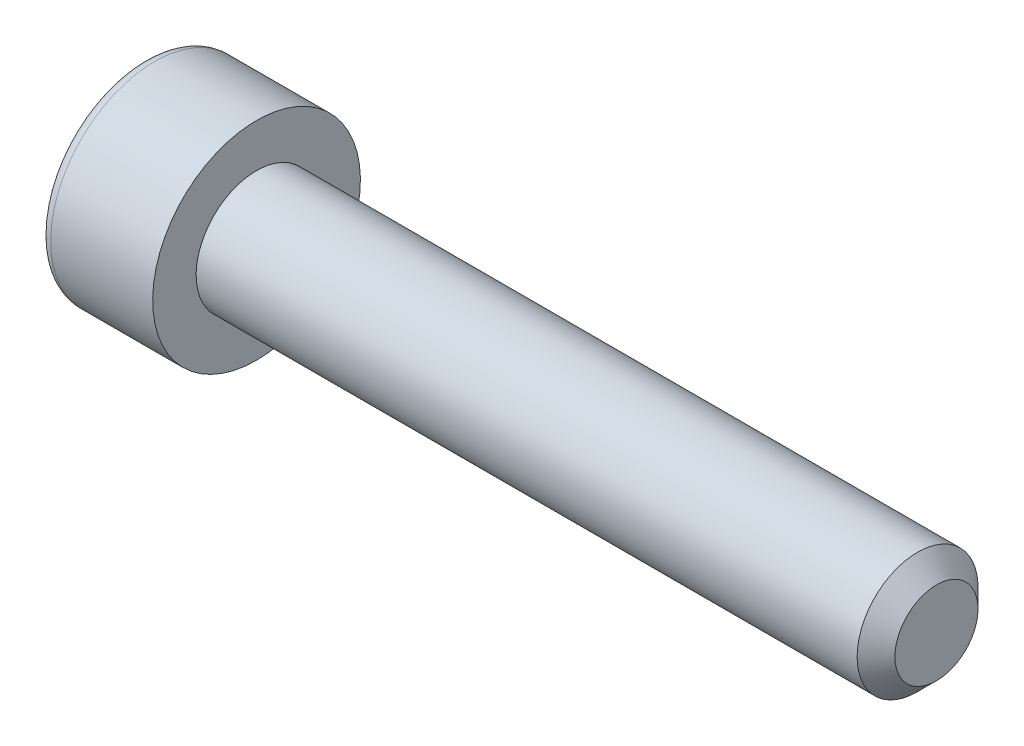
ISO-10303-21;
HEADER;
FILE_DESCRIPTION(('STEP AP214'),'2;1');
FILE_NAME('part.step','',(''),(''),'','','');
FILE_SCHEMA(('AUTOMOTIVE_DESIGN { 1 0 10303 214 1 1 1 1 }'));
ENDSEC;
DATA;
#1=APPLICATION_CONTEXT('core data for automotive mechanical design processes');
#2=APPLICATION_PROTOCOL_DEFINITION('international standard','automotive_design',2000,#1);
#3=PRODUCT_CONTEXT('',#1,'mechanical');
#4=PRODUCT('Part','Part','',(#3));
#5=PRODUCT_RELATED_PRODUCT_CATEGORY('part','',(#4));
#6=PRODUCT_DEFINITION_FORMATION('','',#4);
#7=PRODUCT_DEFINITION_CONTEXT('part definition',#1,'design');
#8=PRODUCT_DEFINITION('design','',#6,#7);
#9=PRODUCT_DEFINITION_SHAPE('','',#8);
#10=(LENGTH_UNIT() NAMED_UNIT(*) SI_UNIT(.MILLI.,.METRE.));
#11=(NAMED_UNIT(*) PLANE_ANGLE_UNIT() SI_UNIT($,.RADIAN.));
#12=(NAMED_UNIT(*) SI_UNIT($,.STERADIAN.) SOLID_ANGLE_UNIT());
#13=UNCERTAINTY_MEASURE_WITH_UNIT(LENGTH_MEASURE(1.E-05),#10,'distance_accuracy_value','');
#14=(GEOMETRIC_REPRESENTATION_CONTEXT(3) GLOBAL_UNCERTAINTY_ASSIGNED_CONTEXT((#13)) GLOBAL_UNIT_ASSIGNED_CONTEXT((#10,
#11,#12)) REPRESENTATION_CONTEXT('',''));
#15=CARTESIAN_POINT('',(0.,0.,0.));
#16=DIRECTION('',(0.,0.,1.));
#17=DIRECTION('',(1.,0.,0.));
#18=AXIS2_PLACEMENT_3D('',#15,#16,#17);
#19=CARTESIAN_POINT('',(-1.70000000002801,0.,0.));
#20=DIRECTION('',(-1.,0.,0.));
#21=DIRECTION('',(0.,0.,1.));
#22=AXIS2_PLACEMENT_3D('',#19,#20,#21);
#23=CONICAL_SURFACE('',#22,1.43650000001117,1.04719755119831);
#24=CARTESIAN_POINT('',(-0.870636338333952,0.,0.));
#25=VERTEX_POINT('',#24);
#26=VERTEX_LOOP('',#25);
#27=FACE_BOUND('',#26,.T.);
#28=CARTESIAN_POINT('',(-1.69999999996238,0.,0.));
#29=DIRECTION('',(-1.,0.,0.));
#30=DIRECTION('',(0.,0.,1.));
#31=AXIS2_PLACEMENT_3D('',#28,#29,#30);
#32=CIRCLE('',#31,1.43649999989748);
#33=CARTESIAN_POINT('',(-1.69999999996238,-0.718249999948738,-1.24404549244756));
#34=VERTEX_POINT('',#33);
#35=CARTESIAN_POINT('',(-1.69999999996238,-1.43649999989748,0.));
#36=VERTEX_POINT('',#35);
#37=EDGE_CURVE('E127',#34,#36,#32,.T.);
#38=ORIENTED_EDGE('',*,*,#37,.T.);
#39=CARTESIAN_POINT('',(-1.70000000002801,0.,0.));
#40=DIRECTION('',(-1.,0.,0.));
#41=DIRECTION('',(0.,0.,1.));
#42=AXIS2_PLACEMENT_3D('',#39,#40,#41);
#43=CIRCLE('',#42,1.43650000001117);
#44=CARTESIAN_POINT('',(-1.70000000002801,-0.718250000005583,1.24404549254602));
#45=VERTEX_POINT('',#44);
#46=EDGE_CURVE('E77',#36,#45,#43,.T.);
#47=ORIENTED_EDGE('',*,*,#46,.T.);
#48=CARTESIAN_POINT('',(-1.70000000002801,0.,0.));
#49=DIRECTION('',(-1.,0.,0.));
#50=DIRECTION('',(0.,0.,1.));
#51=AXIS2_PLACEMENT_3D('',#48,#49,#50);
#52=CIRCLE('',#51,1.43650000001117);
#53=CARTESIAN_POINT('',(-1.70000000002801,0.718250000005582,1.24404549254602));
#54=VERTEX_POINT('',#53);
#55=EDGE_CURVE('E135',#45,#54,#52,.T.);
#56=ORIENTED_EDGE('',*,*,#55,.T.);
#57=CARTESIAN_POINT('',(-1.70000000002801,0.,0.));
#58=DIRECTION('',(-1.,0.,0.));
#59=DIRECTION('',(0.,0.,1.));
#60=AXIS2_PLACEMENT_3D('',#57,#58,#59);
#61=CIRCLE('',#60,1.43650000001116);
#62=CARTESIAN_POINT('',(-1.70000000001401,1.43650000000558,9.66880570697553E-12));
#63=VERTEX_POINT('',#62);
#64=EDGE_CURVE('E133',#54,#63,#61,.T.);
#65=ORIENTED_EDGE('',*,*,#64,.T.);
#66=CARTESIAN_POINT('',(-1.70000000002801,0.,0.));
#67=DIRECTION('',(-1.,0.,0.));
#68=DIRECTION('',(0.,0.,1.));
#69=AXIS2_PLACEMENT_3D('',#66,#67,#68);
#70=CIRCLE('',#69,1.43650000001117);
#71=CARTESIAN_POINT('',(-1.70000000002801,0.718250000005581,-1.24404549254602));
#72=VERTEX_POINT('',#71);
#73=EDGE_CURVE('E131',#63,#72,#70,.T.);
#74=ORIENTED_EDGE('',*,*,#73,.T.);
#75=CARTESIAN_POINT('',(-1.70000000002801,0.,0.));
#76=DIRECTION('',(-1.,0.,0.));
#77=DIRECTION('',(0.,0.,1.));
#78=AXIS2_PLACEMENT_3D('',#75,#76,#77);
#79=CIRCLE('',#78,1.43650000001117);
#80=EDGE_CURVE('E129',#72,#34,#79,.T.);
#81=ORIENTED_EDGE('',*,*,#80,.T.);
#82=EDGE_LOOP('',(#38,#47,#56,#65,#74,#81));
#83=FACE_BOUND('',#82,.T.);
#84=ADVANCED_FACE('F17',(#27,#83),#23,.F.);
#85=CARTESIAN_POINT('',(-1.7,0.,0.));
#86=DIRECTION('',(-1.,0.,0.));
#87=DIRECTION('',(0.,-1.,0.));
#88=AXIS2_PLACEMENT_3D('',#85,#86,#87);
#89=PLANE('',#88);
#90=ORIENTED_EDGE('',*,*,#55,.F.);
#91=DIRECTION('',(0.,1.,0.));
#92=VECTOR('',#91,1.);
#93=CARTESIAN_POINT('',(-1.7,-0.71825,1.24404549253635));
#94=LINE('',#93,#92);
#95=EDGE_CURVE('E91',#45,#54,#94,.T.);
#96=ORIENTED_EDGE('',*,*,#95,.T.);
#97=EDGE_LOOP('',(#90,#96));
#98=FACE_BOUND('',#97,.T.);
#99=ADVANCED_FACE('F200',(#98),#89,.F.);
#100=CARTESIAN_POINT('',(-1.7,0.,0.));
#101=DIRECTION('',(-1.,0.,0.));
#102=DIRECTION('',(0.,-1.,0.));
#103=AXIS2_PLACEMENT_3D('',#100,#101,#102);
#104=PLANE('',#103);
#105=ORIENTED_EDGE('',*,*,#64,.F.);
#106=DIRECTION('',(0.,-0.5,0.866025403784439));
#107=VECTOR('',#106,1.);
#108=CARTESIAN_POINT('',(-1.7,0.71825,1.24404549253635));
#109=LINE('',#108,#107);
#110=EDGE_CURVE('E413',#54,#63,#109,.F.);
#111=ORIENTED_EDGE('',*,*,#110,.T.);
#112=EDGE_LOOP('',(#105,#111));
#113=FACE_BOUND('',#112,.T.);
#114=ADVANCED_FACE('F197',(#113),#104,.F.);
#115=CARTESIAN_POINT('',(-1.7,0.,0.));
#116=DIRECTION('',(-1.,0.,0.));
#117=DIRECTION('',(0.,-1.,0.));
#118=AXIS2_PLACEMENT_3D('',#115,#116,#117);
#119=PLANE('',#118);
#120=ORIENTED_EDGE('',*,*,#73,.F.);
#121=DIRECTION('',(0.,0.5,0.866025403784439));
#122=VECTOR('',#121,1.);
#123=CARTESIAN_POINT('',(-1.7,1.4365,0.));
#124=LINE('',#123,#122);
#125=EDGE_CURVE('E402',#63,#72,#124,.F.);
#126=ORIENTED_EDGE('',*,*,#125,.T.);
#127=EDGE_LOOP('',(#120,#126));
#128=FACE_BOUND('',#127,.T.);
#129=ADVANCED_FACE('F193',(#128),#119,.F.);
#130=CARTESIAN_POINT('',(-1.7,0.,0.));
#131=DIRECTION('',(-1.,0.,0.));
#132=DIRECTION('',(0.,-1.,0.));
#133=AXIS2_PLACEMENT_3D('',#130,#131,#132);
#134=PLANE('',#133);
#135=ORIENTED_EDGE('',*,*,#80,.F.);
#136=DIRECTION('',(0.,1.,0.));
#137=VECTOR('',#136,1.);
#138=CARTESIAN_POINT('',(-1.7,0.71825,-1.24404549253635));
#139=LINE('',#138,#137);
#140=EDGE_CURVE('E391',#72,#34,#139,.F.);
#141=ORIENTED_EDGE('',*,*,#140,.T.);
#142=EDGE_LOOP('',(#135,#141));
#143=FACE_BOUND('',#142,.T.);
#144=ADVANCED_FACE('F189',(#143),#134,.F.);
#145=CARTESIAN_POINT('',(-1.7,0.,0.));
#146=DIRECTION('',(-1.,0.,0.));
#147=DIRECTION('',(0.,-1.,0.));
#148=AXIS2_PLACEMENT_3D('',#145,#146,#147);
#149=PLANE('',#148);
#150=ORIENTED_EDGE('',*,*,#37,.F.);
#151=DIRECTION('',(0.,0.499999999999999,-0.866025403784439));
#152=VECTOR('',#151,1.);
#153=CARTESIAN_POINT('',(-1.7,-0.71825,-1.24404549253635));
#154=LINE('',#153,#152);
#155=EDGE_CURVE('E373',#34,#36,#154,.F.);
#156=ORIENTED_EDGE('',*,*,#155,.T.);
#157=EDGE_LOOP('',(#150,#156));
#158=FACE_BOUND('',#157,.T.);
#159=ADVANCED_FACE('F185',(#158),#149,.F.);
#160=CARTESIAN_POINT('',(-1.7,0.,0.));
#161=DIRECTION('',(-1.,0.,0.));
#162=DIRECTION('',(0.,-1.,0.));
#163=AXIS2_PLACEMENT_3D('',#160,#161,#162);
#164=PLANE('',#163);
#165=ORIENTED_EDGE('',*,*,#46,.F.);
#166=DIRECTION('',(0.,-0.5,-0.866025403784439));
#167=VECTOR('',#166,1.);
#168=CARTESIAN_POINT('',(-1.7,-1.4365,0.));
#169=LINE('',#168,#167);
#170=EDGE_CURVE('E94',#36,#45,#169,.F.);
#171=ORIENTED_EDGE('',*,*,#170,.T.);
#172=EDGE_LOOP('',(#165,#171));
#173=FACE_BOUND('',#172,.T.);
#174=ADVANCED_FACE('F182',(#173),#164,.F.);
#175=CARTESIAN_POINT('',(-1.7,-0.71825,1.24404549253635));
#176=DIRECTION('',(0.,0.,1.));
#177=DIRECTION('',(1.,0.,0.));
#178=AXIS2_PLACEMENT_3D('',#175,#176,#177);
#179=PLANE('',#178);
#180=DIRECTION('',(1.,0.,0.));
#181=VECTOR('',#180,1.);
#182=CARTESIAN_POINT('',(-1.7,0.71825,1.24404549253635));
#183=LINE('',#182,#181);
#184=CARTESIAN_POINT('',(-3.,0.71825,1.24404549253635));
#185=VERTEX_POINT('',#184);
#186=EDGE_CURVE('E378',#185,#54,#183,.T.);
#187=ORIENTED_EDGE('',*,*,#186,.T.);
#188=ORIENTED_EDGE('',*,*,#95,.F.);
#189=DIRECTION('',(1.,0.,0.));
#190=VECTOR('',#189,1.);
#191=CARTESIAN_POINT('',(-1.7,-0.718250000000002,1.24404549253635));
#192=LINE('',#191,#190);
#193=CARTESIAN_POINT('',(-3.,-0.718250000000001,1.24404549253635));
#194=VERTEX_POINT('',#193);
#195=EDGE_CURVE('E83',#45,#194,#192,.F.);
#196=ORIENTED_EDGE('',*,*,#195,.T.);
#197=DIRECTION('',(0.,1.,0.));
#198=VECTOR('',#197,1.);
#199=CARTESIAN_POINT('',(-3.,1.4365,1.24404549253635));
#200=LINE('',#199,#198);
#201=EDGE_CURVE('E88',#194,#185,#200,.T.);
#202=ORIENTED_EDGE('',*,*,#201,.T.);
#203=EDGE_LOOP('',(#187,#188,#196,#202));
#204=FACE_BOUND('',#203,.T.);
#205=ADVANCED_FACE('F86',(#204),#179,.F.);
#206=CARTESIAN_POINT('',(-1.7,0.71825,1.24404549253635));
#207=DIRECTION('',(0.,0.866025403784439,0.5));
#208=DIRECTION('',(0.,-0.5,0.866025403784439));
#209=AXIS2_PLACEMENT_3D('',#206,#207,#208);
#210=PLANE('',#209);
#211=DIRECTION('',(1.,0.,0.));
#212=VECTOR('',#211,1.);
#213=CARTESIAN_POINT('',(-1.7,1.4365,0.));
#214=LINE('',#213,#212);
#215=CARTESIAN_POINT('',(-3.,1.4365,0.));
#216=VERTEX_POINT('',#215);
#217=EDGE_CURVE('E407',#216,#63,#214,.T.);
#218=ORIENTED_EDGE('',*,*,#217,.T.);
#219=ORIENTED_EDGE('',*,*,#110,.F.);
#220=ORIENTED_EDGE('',*,*,#186,.F.);
#221=DIRECTION('',(0.,0.499999999999999,-0.866025403784439));
#222=VECTOR('',#221,1.);
#223=CARTESIAN_POINT('',(-3.,0.71825,1.24404549253635));
#224=LINE('',#223,#222);
#225=EDGE_CURVE('E109',#185,#216,#224,.T.);
#226=ORIENTED_EDGE('',*,*,#225,.T.);
#227=EDGE_LOOP('',(#218,#219,#220,#226));
#228=FACE_BOUND('',#227,.T.);
#229=ADVANCED_FACE('F175',(#228),#210,.F.);
#230=CARTESIAN_POINT('',(-1.7,1.4365,0.));
#231=DIRECTION('',(0.,0.866025403784439,-0.5));
#232=DIRECTION('',(0.,0.5,0.866025403784439));
#233=AXIS2_PLACEMENT_3D('',#230,#231,#232);
#234=PLANE('',#233);
#235=DIRECTION('',(-1.,0.,0.));
#236=VECTOR('',#235,1.);
#237=CARTESIAN_POINT('',(-1.7,0.71825,-1.24404549253635));
#238=LINE('',#237,#236);
#239=CARTESIAN_POINT('',(-3.,0.71825,-1.24404549253635));
#240=VERTEX_POINT('',#239);
#241=EDGE_CURVE('E396',#240,#72,#238,.F.);
#242=ORIENTED_EDGE('',*,*,#241,.T.);
#243=ORIENTED_EDGE('',*,*,#125,.F.);
#244=ORIENTED_EDGE('',*,*,#217,.F.);
#245=DIRECTION('',(0.,-0.500000000000001,-0.866025403784438));
#246=VECTOR('',#245,1.);
#247=CARTESIAN_POINT('',(-3.,1.4365,0.));
#248=LINE('',#247,#246);
#249=EDGE_CURVE('E111',#216,#240,#248,.T.);
#250=ORIENTED_EDGE('',*,*,#249,.T.);
#251=EDGE_LOOP('',(#242,#243,#244,#250));
#252=FACE_BOUND('',#251,.T.);
#253=ADVANCED_FACE('F171',(#252),#234,.F.);
#254=CARTESIAN_POINT('',(-1.7,0.71825,-1.24404549253635));
#255=DIRECTION('',(0.,0.,-1.));
#256=DIRECTION('',(-1.,0.,0.));
#257=AXIS2_PLACEMENT_3D('',#254,#255,#256);
#258=PLANE('',#257);
#259=DIRECTION('',(1.,0.,0.));
#260=VECTOR('',#259,1.);
#261=CARTESIAN_POINT('',(-1.7,-0.71825,-1.24404549253635));
#262=LINE('',#261,#260);
#263=CARTESIAN_POINT('',(-3.,-0.71825,-1.24404549253635));
#264=VERTEX_POINT('',#263);
#265=EDGE_CURVE('E382',#264,#34,#262,.T.);
#266=ORIENTED_EDGE('',*,*,#265,.T.);
#267=ORIENTED_EDGE('',*,*,#140,.F.);
#268=ORIENTED_EDGE('',*,*,#241,.F.);
#269=DIRECTION('',(0.,1.,0.));
#270=VECTOR('',#269,1.);
#271=CARTESIAN_POINT('',(-3.,1.4365,-1.24404549253634));
#272=LINE('',#271,#270);
#273=EDGE_CURVE('E384',#240,#264,#272,.F.);
#274=ORIENTED_EDGE('',*,*,#273,.T.);
#275=EDGE_LOOP('',(#266,#267,#268,#274));
#276=FACE_BOUND('',#275,.T.);
#277=ADVANCED_FACE('F167',(#276),#258,.F.);
#278=CARTESIAN_POINT('',(-1.7,-0.71825,-1.24404549253635));
#279=DIRECTION('',(0.,-0.866025403784439,-0.499999999999999));
#280=DIRECTION('',(0.,0.499999999999999,-0.866025403784439));
#281=AXIS2_PLACEMENT_3D('',#278,#279,#280);
#282=PLANE('',#281);
#283=DIRECTION('',(1.,0.,0.));
#284=VECTOR('',#283,1.);
#285=CARTESIAN_POINT('',(-1.7,-1.4365,0.));
#286=LINE('',#285,#284);
#287=CARTESIAN_POINT('',(-3.,-1.4365,0.));
#288=VERTEX_POINT('',#287);
#289=EDGE_CURVE('E101',#288,#36,#286,.T.);
#290=ORIENTED_EDGE('',*,*,#289,.T.);
#291=ORIENTED_EDGE('',*,*,#155,.F.);
#292=ORIENTED_EDGE('',*,*,#265,.F.);
#293=DIRECTION('',(0.,-0.499999999999999,0.866025403784439));
#294=VECTOR('',#293,1.);
#295=CARTESIAN_POINT('',(-3.,-0.71825,-1.24404549253635));
#296=LINE('',#295,#294);
#297=EDGE_CURVE('E104',#264,#288,#296,.T.);
#298=ORIENTED_EDGE('',*,*,#297,.T.);
#299=EDGE_LOOP('',(#290,#291,#292,#298));
#300=FACE_BOUND('',#299,.T.);
#301=ADVANCED_FACE('F164',(#300),#282,.F.);
#302=CARTESIAN_POINT('',(-1.7,-1.4365,0.));
#303=DIRECTION('',(0.,-0.866025403784439,0.5));
#304=DIRECTION('',(0.,-0.5,-0.866025403784439));
#305=AXIS2_PLACEMENT_3D('',#302,#303,#304);
#306=PLANE('',#305);
#307=ORIENTED_EDGE('',*,*,#195,.F.);
#308=ORIENTED_EDGE('',*,*,#170,.F.);
#309=ORIENTED_EDGE('',*,*,#289,.F.);
#310=DIRECTION('',(0.,0.499999999999999,0.866025403784439));
#311=VECTOR('',#310,1.);
#312=CARTESIAN_POINT('',(-3.,-1.4365,0.));
#313=LINE('',#312,#311);
#314=EDGE_CURVE('E98',#288,#194,#313,.T.);
#315=ORIENTED_EDGE('',*,*,#314,.T.);
#316=EDGE_LOOP('',(#307,#308,#309,#315));
#317=FACE_BOUND('',#316,.T.);
#318=ADVANCED_FACE('F99',(#317),#306,.F.);
#319=CARTESIAN_POINT('',(-3.,1.4365,0.));
#320=DIRECTION('',(1.,0.,0.));
#321=DIRECTION('',(0.,1.,0.));
#322=AXIS2_PLACEMENT_3D('',#319,#320,#321);
#323=PLANE('',#322);
#324=CARTESIAN_POINT('',(-3.,0.,0.));
#325=DIRECTION('',(1.,0.,0.));
#326=DIRECTION('',(0.,-1.,0.));
#327=AXIS2_PLACEMENT_3D('',#324,#325,#326);
#328=CIRCLE('',#327,2.45);
#329=CARTESIAN_POINT('',(-3.,-2.45,0.));
#330=VERTEX_POINT('',#329);
#331=CARTESIAN_POINT('',(-3.,2.45,0.));
#332=VERTEX_POINT('',#331);
#333=EDGE_CURVE('E36',#330,#332,#328,.T.);
#334=ORIENTED_EDGE('',*,*,#333,.F.);
#335=CARTESIAN_POINT('',(-3.,0.,0.));
#336=DIRECTION('',(1.,0.,0.));
#337=DIRECTION('',(0.,1.,0.));
#338=AXIS2_PLACEMENT_3D('',#335,#336,#337);
#339=CIRCLE('',#338,2.45);
#340=EDGE_CURVE('E139',#332,#330,#339,.T.);
#341=ORIENTED_EDGE('',*,*,#340,.F.);
#342=EDGE_LOOP('',(#334,#341));
#343=FACE_BOUND('',#342,.T.);
#344=ORIENTED_EDGE('',*,*,#297,.F.);
#345=ORIENTED_EDGE('',*,*,#273,.F.);
#346=ORIENTED_EDGE('',*,*,#249,.F.);
#347=ORIENTED_EDGE('',*,*,#225,.F.);
#348=ORIENTED_EDGE('',*,*,#201,.F.);
#349=ORIENTED_EDGE('',*,*,#314,.F.);
#350=EDGE_LOOP('',(#344,#345,#346,#347,#348,#349));
#351=FACE_BOUND('',#350,.T.);
#352=ADVANCED_FACE('F107',(#343,#351),#323,.F.);
#353=CARTESIAN_POINT('',(-2.7,0.,0.));
#354=DIRECTION('',(-1.,0.,0.));
#355=DIRECTION('',(0.,1.,0.));
#356=AXIS2_PLACEMENT_3D('',#353,#354,#355);
#357=TOROIDAL_SURFACE('',#356,2.45,0.3);
#358=ORIENTED_EDGE('',*,*,#333,.T.);
#359=ORIENTED_EDGE('',*,*,#340,.T.);
#360=EDGE_LOOP('',(#358,#359));
#361=FACE_BOUND('',#360,.T.);
#362=CARTESIAN_POINT('',(-2.7,0.,0.));
#363=DIRECTION('',(-1.,0.,0.));
#364=DIRECTION('',(0.,-1.,0.));
#365=AXIS2_PLACEMENT_3D('',#362,#363,#364);
#366=CIRCLE('',#365,2.75);
#367=CARTESIAN_POINT('',(-2.7,-2.75,0.));
#368=VERTEX_POINT('',#367);
#369=EDGE_CURVE('E125',#368,#368,#366,.F.);
#370=ORIENTED_EDGE('',*,*,#369,.F.);
#371=EDGE_LOOP('',(#370));
#372=FACE_BOUND('',#371,.T.);
#373=ADVANCED_FACE('F137',(#361,#372),#357,.T.);
#374=CARTESIAN_POINT('',(18.,0.,0.));
#375=DIRECTION('',(1.,0.,0.));
#376=DIRECTION('',(0.,0.,-1.));
#377=AXIS2_PLACEMENT_3D('',#374,#375,#376);
#378=PLANE('',#377);
#379=CARTESIAN_POINT('',(17.9999999999723,0.,0.));
#380=DIRECTION('',(-1.,0.,0.));
#381=DIRECTION('',(0.,0.,1.));
#382=AXIS2_PLACEMENT_3D('',#379,#380,#381);
#383=CIRCLE('',#382,1.1000000000081);
#384=CARTESIAN_POINT('',(17.9999999999723,0.,1.1000000000081));
#385=VERTEX_POINT('',#384);
#386=EDGE_CURVE('E122',#385,#385,#383,.T.);
#387=ORIENTED_EDGE('',*,*,#386,.F.);
#388=EDGE_LOOP('',(#387));
#389=FACE_BOUND('',#388,.T.);
#390=ADVANCED_FACE('F227',(#389),#378,.T.);
#391=CARTESIAN_POINT('',(-0.870636338309101,0.,0.));
#392=DIRECTION('',(-1.,0.,0.));
#393=DIRECTION('',(0.,-1.,0.));
#394=AXIS2_PLACEMENT_3D('',#391,#392,#393);
#395=CYLINDRICAL_SURFACE('',#394,2.75);
#396=ORIENTED_EDGE('',*,*,#369,.T.);
#397=EDGE_LOOP('',(#396));
#398=FACE_BOUND('',#397,.T.);
#399=CARTESIAN_POINT('',(0.,0.,0.));
#400=DIRECTION('',(-1.,0.,0.));
#401=DIRECTION('',(0.,-1.,0.));
#402=AXIS2_PLACEMENT_3D('',#399,#400,#401);
#403=CIRCLE('',#402,2.75);
#404=CARTESIAN_POINT('',(0.,-2.75,0.));
#405=VERTEX_POINT('',#404);
#406=EDGE_CURVE('E119',#405,#405,#403,.T.);
#407=ORIENTED_EDGE('',*,*,#406,.T.);
#408=EDGE_LOOP('',(#407));
#409=FACE_BOUND('',#408,.T.);
#410=ADVANCED_FACE('F224',(#398,#409),#395,.T.);
#411=CARTESIAN_POINT('',(17.4999999999841,0.,0.));
#412=DIRECTION('',(-1.,0.,0.));
#413=DIRECTION('',(0.,0.,1.));
#414=AXIS2_PLACEMENT_3D('',#411,#412,#413);
#415=CONICAL_SURFACE('',#414,1.59999999999627,0.785398163397448);
#416=CARTESIAN_POINT('',(17.5,0.,0.));
#417=DIRECTION('',(-1.,0.,0.));
#418=DIRECTION('',(0.,-1.,0.));
#419=AXIS2_PLACEMENT_3D('',#416,#417,#418);
#420=CIRCLE('',#419,1.6);
#421=CARTESIAN_POINT('',(17.5,-1.6,0.));
#422=VERTEX_POINT('',#421);
#423=EDGE_CURVE('E28',#422,#422,#420,.T.);
#424=ORIENTED_EDGE('',*,*,#423,.F.);
#425=EDGE_LOOP('',(#424));
#426=FACE_BOUND('',#425,.T.);
#427=ORIENTED_EDGE('',*,*,#386,.T.);
#428=EDGE_LOOP('',(#427));
#429=FACE_BOUND('',#428,.T.);
#430=ADVANCED_FACE('F217',(#426,#429),#415,.T.);
#431=CARTESIAN_POINT('',(0.,2.75,0.));
#432=DIRECTION('',(-1.,0.,0.));
#433=DIRECTION('',(0.,-1.,0.));
#434=AXIS2_PLACEMENT_3D('',#431,#432,#433);
#435=PLANE('',#434);
#436=CARTESIAN_POINT('',(0.,0.,0.));
#437=DIRECTION('',(-1.,0.,0.));
#438=DIRECTION('',(0.,-1.,0.));
#439=AXIS2_PLACEMENT_3D('',#436,#437,#438);
#440=CIRCLE('',#439,1.6);
#441=CARTESIAN_POINT('',(0.,-1.6,0.));
#442=VERTEX_POINT('',#441);
#443=EDGE_CURVE('E10',#442,#442,#440,.F.);
#444=ORIENTED_EDGE('',*,*,#443,.F.);
#445=EDGE_LOOP('',(#444));
#446=FACE_BOUND('',#445,.T.);
#447=ORIENTED_EDGE('',*,*,#406,.F.);
#448=EDGE_LOOP('',(#447));
#449=FACE_BOUND('',#448,.T.);
#450=ADVANCED_FACE('F211',(#446,#449),#435,.F.);
#451=CARTESIAN_POINT('',(16.,0.,0.));
#452=DIRECTION('',(-1.,0.,0.));
#453=DIRECTION('',(0.,-1.,0.));
#454=AXIS2_PLACEMENT_3D('',#451,#452,#453);
#455=CYLINDRICAL_SURFACE('',#454,1.6);
#456=ORIENTED_EDGE('',*,*,#443,.T.);
#457=EDGE_LOOP('',(#456));
#458=FACE_BOUND('',#457,.T.);
#459=ORIENTED_EDGE('',*,*,#423,.T.);
#460=EDGE_LOOP('',(#459));
#461=FACE_BOUND('',#460,.T.);
#462=ADVANCED_FACE('F209',(#458,#461),#455,.T.);
#463=CLOSED_SHELL('',(#84,#99,#114,#129,#144,#159,#174,#205,#229,#253,#277,#301,#318,#352,#373,
#390,#410,#430,#450,#462));
#464=MANIFOLD_SOLID_BREP('B1',#463);
#465=ADVANCED_BREP_SHAPE_REPRESENTATION('',(#18,#464),#14);
#466=SHAPE_DEFINITION_REPRESENTATION(#9,#465);
ENDSEC;
END-ISO-10303-21;
